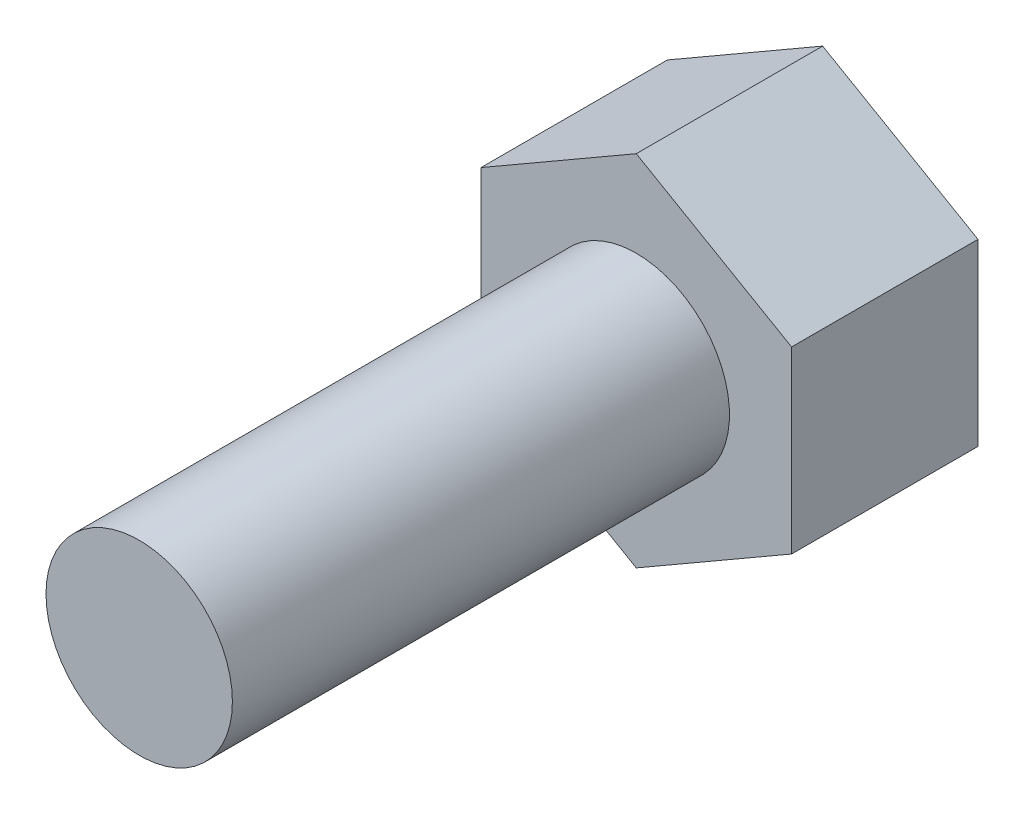
ISO-10303-21;
HEADER;
FILE_DESCRIPTION(('STEP AP214'),'2;1');
FILE_NAME('part.step','',(''),(''),'','','');
FILE_SCHEMA(('AUTOMOTIVE_DESIGN { 1 0 10303 214 1 1 1 1 }'));
ENDSEC;
DATA;
#1=APPLICATION_CONTEXT('core data for automotive mechanical design processes');
#2=APPLICATION_PROTOCOL_DEFINITION('international standard','automotive_design',2000,#1);
#3=PRODUCT_CONTEXT('',#1,'mechanical');
#4=PRODUCT('Part','Part','',(#3));
#5=PRODUCT_RELATED_PRODUCT_CATEGORY('part','',(#4));
#6=PRODUCT_DEFINITION_FORMATION('','',#4);
#7=PRODUCT_DEFINITION_CONTEXT('part definition',#1,'design');
#8=PRODUCT_DEFINITION('design','',#6,#7);
#9=PRODUCT_DEFINITION_SHAPE('','',#8);
#10=(LENGTH_UNIT() NAMED_UNIT(*) SI_UNIT(.MILLI.,.METRE.));
#11=(NAMED_UNIT(*) PLANE_ANGLE_UNIT() SI_UNIT($,.RADIAN.));
#12=(NAMED_UNIT(*) SI_UNIT($,.STERADIAN.) SOLID_ANGLE_UNIT());
#13=UNCERTAINTY_MEASURE_WITH_UNIT(LENGTH_MEASURE(1.E-05),#10,'distance_accuracy_value','');
#14=(GEOMETRIC_REPRESENTATION_CONTEXT(3) GLOBAL_UNCERTAINTY_ASSIGNED_CONTEXT((#13)) GLOBAL_UNIT_ASSIGNED_CONTEXT((#10,
#11,#12)) REPRESENTATION_CONTEXT('',''));
#15=CARTESIAN_POINT('',(0.,0.,0.));
#16=DIRECTION('',(0.,0.,1.));
#17=DIRECTION('',(1.,0.,0.));
#18=AXIS2_PLACEMENT_3D('',#15,#16,#17);
#19=CARTESIAN_POINT('',(-63.4947615904966,14.9787081339713,8.));
#20=DIRECTION('',(0.,0.,-1.));
#21=DIRECTION('',(-1.,0.,0.));
#22=AXIS2_PLACEMENT_3D('',#19,#20,#21);
#23=CYLINDRICAL_SURFACE('',#22,1.5);
#24=CARTESIAN_POINT('',(-63.4947615904966,14.9787081339713,8.));
#25=DIRECTION('',(0.,0.,1.));
#26=DIRECTION('',(1.,0.,0.));
#27=AXIS2_PLACEMENT_3D('',#24,#25,#26);
#28=CIRCLE('',#27,1.5);
#29=CARTESIAN_POINT('',(-61.9947615904966,14.9787081339713,8.));
#30=VERTEX_POINT('',#29);
#31=EDGE_CURVE('E11',#30,#30,#28,.T.);
#32=ORIENTED_EDGE('',*,*,#31,.F.);
#33=EDGE_LOOP('',(#32));
#34=FACE_BOUND('',#33,.T.);
#35=CARTESIAN_POINT('',(-63.4947615904966,14.9787081339713,0.));
#36=DIRECTION('',(0.,0.,-1.));
#37=DIRECTION('',(-1.,0.,0.));
#38=AXIS2_PLACEMENT_3D('',#35,#36,#37);
#39=CIRCLE('',#38,1.5);
#40=CARTESIAN_POINT('',(-64.9947615904966,14.9787081339713,0.));
#41=VERTEX_POINT('',#40);
#42=EDGE_CURVE('E41',#41,#41,#39,.T.);
#43=ORIENTED_EDGE('',*,*,#42,.F.);
#44=EDGE_LOOP('',(#43));
#45=FACE_BOUND('',#44,.T.);
#46=ADVANCED_FACE('F33',(#34,#45),#23,.T.);
#47=CARTESIAN_POINT('',(-63.4947615904966,14.9787081339713,8.));
#48=DIRECTION('',(0.,0.,1.));
#49=DIRECTION('',(1.,0.,0.));
#50=AXIS2_PLACEMENT_3D('',#47,#48,#49);
#51=PLANE('',#50);
#52=ORIENTED_EDGE('',*,*,#31,.T.);
#53=EDGE_LOOP('',(#52));
#54=FACE_BOUND('',#53,.T.);
#55=ADVANCED_FACE('F143',(#54),#51,.T.);
#56=CARTESIAN_POINT('',(-60.9947615904966,13.5353324609972,-3.));
#57=DIRECTION('',(-0.5,0.866025403784439,0.));
#58=DIRECTION('',(-0.866025403784439,-0.5,0.));
#59=AXIS2_PLACEMENT_3D('',#56,#57,#58);
#60=PLANE('',#59);
#61=DIRECTION('',(-0.866025403784439,-0.5,0.));
#62=VECTOR('',#61,1.);
#63=CARTESIAN_POINT('',(-60.9947615904966,13.5353324609972,0.));
#64=LINE('',#63,#62);
#65=CARTESIAN_POINT('',(-60.9947615904966,13.5353324609972,0.));
#66=VERTEX_POINT('',#65);
#67=CARTESIAN_POINT('',(-63.4947615904967,12.0919567880232,0.));
#68=VERTEX_POINT('',#67);
#69=EDGE_CURVE('E118',#66,#68,#64,.T.);
#70=ORIENTED_EDGE('',*,*,#69,.T.);
#71=DIRECTION('',(0.,0.,1.));
#72=VECTOR('',#71,1.);
#73=CARTESIAN_POINT('',(-63.4947615904967,12.0919567880232,-3.));
#74=LINE('',#73,#72);
#75=CARTESIAN_POINT('',(-63.4947615904967,12.0919567880232,-3.));
#76=VERTEX_POINT('',#75);
#77=EDGE_CURVE('E135',#76,#68,#74,.T.);
#78=ORIENTED_EDGE('',*,*,#77,.F.);
#79=DIRECTION('',(-0.866025403784439,-0.5,0.));
#80=VECTOR('',#79,1.);
#81=CARTESIAN_POINT('',(-60.9947615904966,13.5353324609972,-3.));
#82=LINE('',#81,#80);
#83=CARTESIAN_POINT('',(-60.9947615904966,13.5353324609972,-3.));
#84=VERTEX_POINT('',#83);
#85=EDGE_CURVE('E128',#84,#76,#82,.T.);
#86=ORIENTED_EDGE('',*,*,#85,.F.);
#87=DIRECTION('',(0.,0.,1.));
#88=VECTOR('',#87,1.);
#89=CARTESIAN_POINT('',(-60.9947615904966,13.5353324609972,-3.));
#90=LINE('',#89,#88);
#91=EDGE_CURVE('E114',#84,#66,#90,.T.);
#92=ORIENTED_EDGE('',*,*,#91,.T.);
#93=EDGE_LOOP('',(#70,#78,#86,#92));
#94=FACE_BOUND('',#93,.T.);
#95=ADVANCED_FACE('F148',(#94),#60,.F.);
#96=CARTESIAN_POINT('',(-63.4947615904967,12.0919567880232,-3.));
#97=DIRECTION('',(0.5,0.866025403784438,0.));
#98=DIRECTION('',(-0.866025403784438,0.5,0.));
#99=AXIS2_PLACEMENT_3D('',#96,#97,#98);
#100=PLANE('',#99);
#101=DIRECTION('',(-0.866025403784438,0.5,0.));
#102=VECTOR('',#101,1.);
#103=CARTESIAN_POINT('',(-63.4947615904967,12.0919567880232,0.));
#104=LINE('',#103,#102);
#105=CARTESIAN_POINT('',(-65.9947615904966,13.5353324609972,0.));
#106=VERTEX_POINT('',#105);
#107=EDGE_CURVE('E121',#68,#106,#104,.T.);
#108=ORIENTED_EDGE('',*,*,#107,.T.);
#109=DIRECTION('',(0.,0.,1.));
#110=VECTOR('',#109,1.);
#111=CARTESIAN_POINT('',(-65.9947615904966,13.5353324609972,-3.));
#112=LINE('',#111,#110);
#113=CARTESIAN_POINT('',(-65.9947615904966,13.5353324609972,-3.));
#114=VERTEX_POINT('',#113);
#115=EDGE_CURVE('E132',#114,#106,#112,.T.);
#116=ORIENTED_EDGE('',*,*,#115,.F.);
#117=DIRECTION('',(-0.866025403784438,0.5,0.));
#118=VECTOR('',#117,1.);
#119=CARTESIAN_POINT('',(-63.4947615904967,12.0919567880232,-3.));
#120=LINE('',#119,#118);
#121=EDGE_CURVE('E87',#76,#114,#120,.T.);
#122=ORIENTED_EDGE('',*,*,#121,.F.);
#123=ORIENTED_EDGE('',*,*,#77,.T.);
#124=EDGE_LOOP('',(#108,#116,#122,#123));
#125=FACE_BOUND('',#124,.T.);
#126=ADVANCED_FACE('F154',(#125),#100,.F.);
#127=CARTESIAN_POINT('',(-65.9947615904966,13.5353324609972,-3.));
#128=DIRECTION('',(1.,0.,0.));
#129=DIRECTION('',(0.,0.,-1.));
#130=AXIS2_PLACEMENT_3D('',#127,#128,#129);
#131=PLANE('',#130);
#132=DIRECTION('',(0.,1.,0.));
#133=VECTOR('',#132,1.);
#134=CARTESIAN_POINT('',(-65.9947615904966,13.5353324609972,0.));
#135=LINE('',#134,#133);
#136=CARTESIAN_POINT('',(-65.9947615904966,16.4220838069454,0.));
#137=VERTEX_POINT('',#136);
#138=EDGE_CURVE('E123',#106,#137,#135,.T.);
#139=ORIENTED_EDGE('',*,*,#138,.T.);
#140=DIRECTION('',(0.,0.,1.));
#141=VECTOR('',#140,1.);
#142=CARTESIAN_POINT('',(-65.9947615904966,16.4220838069454,-3.));
#143=LINE('',#142,#141);
#144=CARTESIAN_POINT('',(-65.9947615904966,16.4220838069454,-3.));
#145=VERTEX_POINT('',#144);
#146=EDGE_CURVE('E109',#145,#137,#143,.T.);
#147=ORIENTED_EDGE('',*,*,#146,.F.);
#148=DIRECTION('',(0.,1.,0.));
#149=VECTOR('',#148,1.);
#150=CARTESIAN_POINT('',(-65.9947615904966,13.5353324609972,-3.));
#151=LINE('',#150,#149);
#152=EDGE_CURVE('E100',#114,#145,#151,.T.);
#153=ORIENTED_EDGE('',*,*,#152,.F.);
#154=ORIENTED_EDGE('',*,*,#115,.T.);
#155=EDGE_LOOP('',(#139,#147,#153,#154));
#156=FACE_BOUND('',#155,.T.);
#157=ADVANCED_FACE('F160',(#156),#131,.F.);
#158=CARTESIAN_POINT('',(-65.9947615904966,16.4220838069454,-3.));
#159=DIRECTION('',(0.499999999999999,-0.866025403784439,0.));
#160=DIRECTION('',(0.866025403784439,0.499999999999999,0.));
#161=AXIS2_PLACEMENT_3D('',#158,#159,#160);
#162=PLANE('',#161);
#163=DIRECTION('',(0.866025403784439,0.499999999999999,0.));
#164=VECTOR('',#163,1.);
#165=CARTESIAN_POINT('',(-65.9947615904966,16.4220838069454,0.));
#166=LINE('',#165,#164);
#167=CARTESIAN_POINT('',(-63.4947615904966,17.8654594799194,0.));
#168=VERTEX_POINT('',#167);
#169=EDGE_CURVE('E108',#137,#168,#166,.T.);
#170=ORIENTED_EDGE('',*,*,#169,.T.);
#171=DIRECTION('',(0.,0.,1.));
#172=VECTOR('',#171,1.);
#173=CARTESIAN_POINT('',(-63.4947615904966,17.8654594799194,-3.));
#174=LINE('',#173,#172);
#175=CARTESIAN_POINT('',(-63.4947615904966,17.8654594799194,-3.));
#176=VERTEX_POINT('',#175);
#177=EDGE_CURVE('E105',#176,#168,#174,.T.);
#178=ORIENTED_EDGE('',*,*,#177,.F.);
#179=DIRECTION('',(0.866025403784439,0.499999999999999,0.));
#180=VECTOR('',#179,1.);
#181=CARTESIAN_POINT('',(-65.9947615904966,16.4220838069454,-3.));
#182=LINE('',#181,#180);
#183=EDGE_CURVE('E94',#145,#176,#182,.T.);
#184=ORIENTED_EDGE('',*,*,#183,.F.);
#185=ORIENTED_EDGE('',*,*,#146,.T.);
#186=EDGE_LOOP('',(#170,#178,#184,#185));
#187=FACE_BOUND('',#186,.T.);
#188=ADVANCED_FACE('F106',(#187),#162,.F.);
#189=CARTESIAN_POINT('',(-63.4947615904966,17.8654594799194,-3.));
#190=DIRECTION('',(-0.500000000000001,-0.866025403784438,0.));
#191=DIRECTION('',(0.866025403784438,-0.500000000000001,0.));
#192=AXIS2_PLACEMENT_3D('',#189,#190,#191);
#193=PLANE('',#192);
#194=DIRECTION('',(0.866025403784438,-0.500000000000001,0.));
#195=VECTOR('',#194,1.);
#196=CARTESIAN_POINT('',(-63.4947615904966,17.8654594799194,0.));
#197=LINE('',#196,#195);
#198=CARTESIAN_POINT('',(-60.9947615904966,16.4220838069454,0.));
#199=VERTEX_POINT('',#198);
#200=EDGE_CURVE('E72',#168,#199,#197,.T.);
#201=ORIENTED_EDGE('',*,*,#200,.T.);
#202=DIRECTION('',(0.,0.,1.));
#203=VECTOR('',#202,1.);
#204=CARTESIAN_POINT('',(-60.9947615904966,16.4220838069454,-3.));
#205=LINE('',#204,#203);
#206=CARTESIAN_POINT('',(-60.9947615904966,16.4220838069454,-3.));
#207=VERTEX_POINT('',#206);
#208=EDGE_CURVE('E110',#207,#199,#205,.T.);
#209=ORIENTED_EDGE('',*,*,#208,.F.);
#210=DIRECTION('',(0.866025403784438,-0.500000000000001,0.));
#211=VECTOR('',#210,1.);
#212=CARTESIAN_POINT('',(-63.4947615904966,17.8654594799194,-3.));
#213=LINE('',#212,#211);
#214=EDGE_CURVE('E98',#176,#207,#213,.T.);
#215=ORIENTED_EDGE('',*,*,#214,.F.);
#216=ORIENTED_EDGE('',*,*,#177,.T.);
#217=EDGE_LOOP('',(#201,#209,#215,#216));
#218=FACE_BOUND('',#217,.T.);
#219=ADVANCED_FACE('F112',(#218),#193,.F.);
#220=CARTESIAN_POINT('',(-60.9947615904966,16.4220838069454,-3.));
#221=DIRECTION('',(-1.,0.,0.));
#222=DIRECTION('',(0.,0.,1.));
#223=AXIS2_PLACEMENT_3D('',#220,#221,#222);
#224=PLANE('',#223);
#225=DIRECTION('',(0.,-1.,0.));
#226=VECTOR('',#225,1.);
#227=CARTESIAN_POINT('',(-60.9947615904966,16.4220838069454,0.));
#228=LINE('',#227,#226);
#229=EDGE_CURVE('E78',#199,#66,#228,.T.);
#230=ORIENTED_EDGE('',*,*,#229,.T.);
#231=ORIENTED_EDGE('',*,*,#91,.F.);
#232=DIRECTION('',(0.,-1.,0.));
#233=VECTOR('',#232,1.);
#234=CARTESIAN_POINT('',(-60.9947615904966,16.4220838069454,-3.));
#235=LINE('',#234,#233);
#236=EDGE_CURVE('E49',#207,#84,#235,.T.);
#237=ORIENTED_EDGE('',*,*,#236,.F.);
#238=ORIENTED_EDGE('',*,*,#208,.T.);
#239=EDGE_LOOP('',(#230,#231,#237,#238));
#240=FACE_BOUND('',#239,.T.);
#241=ADVANCED_FACE('F168',(#240),#224,.F.);
#242=CARTESIAN_POINT('',(0.,0.,-3.));
#243=DIRECTION('',(0.,0.,-1.));
#244=DIRECTION('',(-1.,0.,0.));
#245=AXIS2_PLACEMENT_3D('',#242,#243,#244);
#246=PLANE('',#245);
#247=ORIENTED_EDGE('',*,*,#85,.T.);
#248=ORIENTED_EDGE('',*,*,#121,.T.);
#249=ORIENTED_EDGE('',*,*,#152,.T.);
#250=ORIENTED_EDGE('',*,*,#183,.T.);
#251=ORIENTED_EDGE('',*,*,#214,.T.);
#252=ORIENTED_EDGE('',*,*,#236,.T.);
#253=EDGE_LOOP('',(#247,#248,#249,#250,#251,#252));
#254=FACE_BOUND('',#253,.T.);
#255=ADVANCED_FACE('F96',(#254),#246,.T.);
#256=CARTESIAN_POINT('',(0.,0.,0.));
#257=DIRECTION('',(0.,0.,-1.));
#258=DIRECTION('',(-1.,0.,0.));
#259=AXIS2_PLACEMENT_3D('',#256,#257,#258);
#260=PLANE('',#259);
#261=ORIENTED_EDGE('',*,*,#42,.T.);
#262=EDGE_LOOP('',(#261));
#263=FACE_BOUND('',#262,.T.);
#264=ORIENTED_EDGE('',*,*,#69,.F.);
#265=ORIENTED_EDGE('',*,*,#229,.F.);
#266=ORIENTED_EDGE('',*,*,#200,.F.);
#267=ORIENTED_EDGE('',*,*,#169,.F.);
#268=ORIENTED_EDGE('',*,*,#138,.F.);
#269=ORIENTED_EDGE('',*,*,#107,.F.);
#270=EDGE_LOOP('',(#264,#265,#266,#267,#268,#269));
#271=FACE_BOUND('',#270,.T.);
#272=ADVANCED_FACE('F139',(#263,#271),#260,.F.);
#273=CLOSED_SHELL('',(#46,#55,#95,#126,#157,#188,#219,#241,#255,#272));
#274=MANIFOLD_SOLID_BREP('B2',#273);
#275=ADVANCED_BREP_SHAPE_REPRESENTATION('',(#18,#274),#14);
#276=SHAPE_DEFINITION_REPRESENTATION(#9,#275);
ENDSEC;
END-ISO-10303-21;
